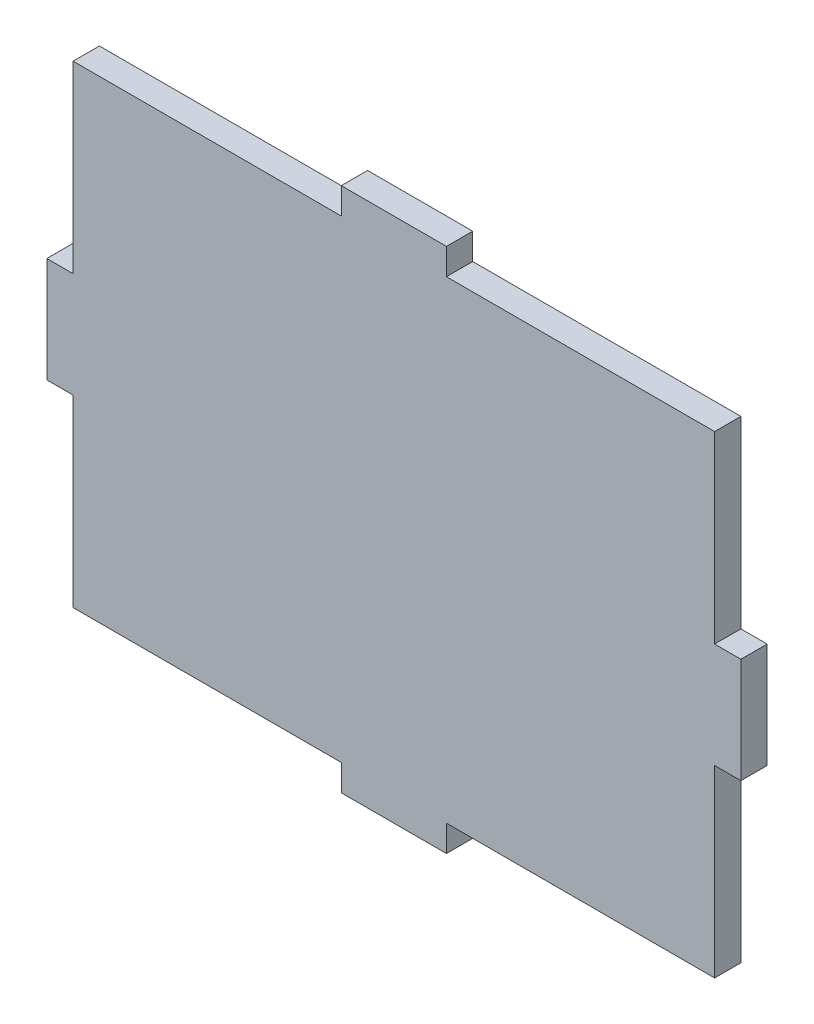
ISO-10303-21;
HEADER;
FILE_DESCRIPTION(('STEP AP214'),'2;1');
FILE_NAME('part.step','',(''),(''),'','','');
FILE_SCHEMA(('AUTOMOTIVE_DESIGN { 1 0 10303 214 1 1 1 1 }'));
ENDSEC;
DATA;
#1=APPLICATION_CONTEXT('core data for automotive mechanical design processes');
#2=APPLICATION_PROTOCOL_DEFINITION('international standard','automotive_design',2000,#1);
#3=PRODUCT_CONTEXT('',#1,'mechanical');
#4=PRODUCT('Part','Part','',(#3));
#5=PRODUCT_RELATED_PRODUCT_CATEGORY('part','',(#4));
#6=PRODUCT_DEFINITION_FORMATION('','',#4);
#7=PRODUCT_DEFINITION_CONTEXT('part definition',#1,'design');
#8=PRODUCT_DEFINITION('design','',#6,#7);
#9=PRODUCT_DEFINITION_SHAPE('','',#8);
#10=(LENGTH_UNIT() NAMED_UNIT(*) SI_UNIT(.MILLI.,.METRE.));
#11=(NAMED_UNIT(*) PLANE_ANGLE_UNIT() SI_UNIT($,.RADIAN.));
#12=(NAMED_UNIT(*) SI_UNIT($,.STERADIAN.) SOLID_ANGLE_UNIT());
#13=UNCERTAINTY_MEASURE_WITH_UNIT(LENGTH_MEASURE(1.E-05),#10,'distance_accuracy_value','');
#14=(GEOMETRIC_REPRESENTATION_CONTEXT(3) GLOBAL_UNCERTAINTY_ASSIGNED_CONTEXT((#13)) GLOBAL_UNIT_ASSIGNED_CONTEXT((#10,
#11,#12)) REPRESENTATION_CONTEXT('',''));
#15=CARTESIAN_POINT('',(0.,0.,0.));
#16=DIRECTION('',(0.,0.,1.));
#17=DIRECTION('',(1.,0.,0.));
#18=AXIS2_PLACEMENT_3D('',#15,#16,#17);
#19=CARTESIAN_POINT('',(38.735,6.35,3.175));
#20=DIRECTION('',(-1.,0.,0.));
#21=DIRECTION('',(0.,0.,1.));
#22=AXIS2_PLACEMENT_3D('',#19,#20,#21);
#23=PLANE('',#22);
#24=DIRECTION('',(0.,1.,0.));
#25=VECTOR('',#24,1.);
#26=CARTESIAN_POINT('',(38.735,6.35,0.));
#27=LINE('',#26,#25);
#28=CARTESIAN_POINT('',(38.735,6.35,0.));
#29=VERTEX_POINT('',#28);
#30=CARTESIAN_POINT('',(38.735,28.575,0.));
#31=VERTEX_POINT('',#30);
#32=EDGE_CURVE('E212',#29,#31,#27,.T.);
#33=ORIENTED_EDGE('',*,*,#32,.T.);
#34=DIRECTION('',(0.,0.,-1.));
#35=VECTOR('',#34,1.);
#36=CARTESIAN_POINT('',(38.735,28.575,3.175));
#37=LINE('',#36,#35);
#38=CARTESIAN_POINT('',(38.735,28.575,3.175));
#39=VERTEX_POINT('',#38);
#40=EDGE_CURVE('E11',#39,#31,#37,.T.);
#41=ORIENTED_EDGE('',*,*,#40,.F.);
#42=DIRECTION('',(0.,1.,0.));
#43=VECTOR('',#42,1.);
#44=CARTESIAN_POINT('',(38.735,6.35,3.175));
#45=LINE('',#44,#43);
#46=CARTESIAN_POINT('',(38.735,6.35,3.175));
#47=VERTEX_POINT('',#46);
#48=EDGE_CURVE('E270',#47,#39,#45,.T.);
#49=ORIENTED_EDGE('',*,*,#48,.F.);
#50=DIRECTION('',(0.,0.,-1.));
#51=VECTOR('',#50,1.);
#52=CARTESIAN_POINT('',(38.735,6.35,3.175));
#53=LINE('',#52,#51);
#54=EDGE_CURVE('E208',#47,#29,#53,.T.);
#55=ORIENTED_EDGE('',*,*,#54,.T.);
#56=EDGE_LOOP('',(#33,#41,#49,#55));
#57=FACE_BOUND('',#56,.T.);
#58=ADVANCED_FACE('F39',(#57),#23,.F.);
#59=CARTESIAN_POINT('',(6.34999999999999,28.575,3.175));
#60=DIRECTION('',(0.,-1.,0.));
#61=DIRECTION('',(0.,0.,-1.));
#62=AXIS2_PLACEMENT_3D('',#59,#60,#61);
#63=PLANE('',#62);
#64=DIRECTION('',(-1.,0.,0.));
#65=VECTOR('',#64,1.);
#66=CARTESIAN_POINT('',(6.34999999999999,28.575,0.));
#67=LINE('',#66,#65);
#68=CARTESIAN_POINT('',(6.34999999999999,28.575,0.));
#69=VERTEX_POINT('',#68);
#70=EDGE_CURVE('E216',#31,#69,#67,.T.);
#71=ORIENTED_EDGE('',*,*,#70,.T.);
#72=DIRECTION('',(0.,0.,-1.));
#73=VECTOR('',#72,1.);
#74=CARTESIAN_POINT('',(6.34999999999999,28.575,3.175));
#75=LINE('',#74,#73);
#76=CARTESIAN_POINT('',(6.34999999999999,28.575,3.175));
#77=VERTEX_POINT('',#76);
#78=EDGE_CURVE('E48',#77,#69,#75,.T.);
#79=ORIENTED_EDGE('',*,*,#78,.F.);
#80=DIRECTION('',(-1.,0.,0.));
#81=VECTOR('',#80,1.);
#82=CARTESIAN_POINT('',(6.34999999999999,28.575,3.175));
#83=LINE('',#82,#81);
#84=EDGE_CURVE('E135',#39,#77,#83,.T.);
#85=ORIENTED_EDGE('',*,*,#84,.F.);
#86=ORIENTED_EDGE('',*,*,#40,.T.);
#87=EDGE_LOOP('',(#71,#79,#85,#86));
#88=FACE_BOUND('',#87,.T.);
#89=ADVANCED_FACE('F420',(#88),#63,.F.);
#90=CARTESIAN_POINT('',(6.34999999999999,31.75,3.175));
#91=DIRECTION('',(-1.,0.,0.));
#92=DIRECTION('',(0.,0.,1.));
#93=AXIS2_PLACEMENT_3D('',#90,#91,#92);
#94=PLANE('',#93);
#95=DIRECTION('',(0.,1.,0.));
#96=VECTOR('',#95,1.);
#97=CARTESIAN_POINT('',(6.34999999999999,31.75,0.));
#98=LINE('',#97,#96);
#99=CARTESIAN_POINT('',(6.34999999999999,31.75,0.));
#100=VERTEX_POINT('',#99);
#101=EDGE_CURVE('E219',#69,#100,#98,.T.);
#102=ORIENTED_EDGE('',*,*,#101,.T.);
#103=DIRECTION('',(0.,0.,-1.));
#104=VECTOR('',#103,1.);
#105=CARTESIAN_POINT('',(6.34999999999999,31.75,3.175));
#106=LINE('',#105,#104);
#107=CARTESIAN_POINT('',(6.34999999999999,31.75,3.175));
#108=VERTEX_POINT('',#107);
#109=EDGE_CURVE('E329',#108,#100,#106,.T.);
#110=ORIENTED_EDGE('',*,*,#109,.F.);
#111=DIRECTION('',(0.,1.,0.));
#112=VECTOR('',#111,1.);
#113=CARTESIAN_POINT('',(6.34999999999999,31.75,3.175));
#114=LINE('',#113,#112);
#115=EDGE_CURVE('E339',#77,#108,#114,.T.);
#116=ORIENTED_EDGE('',*,*,#115,.F.);
#117=ORIENTED_EDGE('',*,*,#78,.T.);
#118=EDGE_LOOP('',(#102,#110,#116,#117));
#119=FACE_BOUND('',#118,.T.);
#120=ADVANCED_FACE('F337',(#119),#94,.F.);
#121=CARTESIAN_POINT('',(-6.35,31.75,3.175));
#122=DIRECTION('',(0.,-1.,0.));
#123=DIRECTION('',(0.,0.,-1.));
#124=AXIS2_PLACEMENT_3D('',#121,#122,#123);
#125=PLANE('',#124);
#126=DIRECTION('',(-1.,0.,0.));
#127=VECTOR('',#126,1.);
#128=CARTESIAN_POINT('',(-6.35,31.75,0.));
#129=LINE('',#128,#127);
#130=CARTESIAN_POINT('',(-6.35,31.75,0.));
#131=VERTEX_POINT('',#130);
#132=EDGE_CURVE('E222',#100,#131,#129,.T.);
#133=ORIENTED_EDGE('',*,*,#132,.T.);
#134=DIRECTION('',(0.,0.,-1.));
#135=VECTOR('',#134,1.);
#136=CARTESIAN_POINT('',(-6.35,31.75,3.175));
#137=LINE('',#136,#135);
#138=CARTESIAN_POINT('',(-6.35,31.75,3.175));
#139=VERTEX_POINT('',#138);
#140=EDGE_CURVE('E325',#139,#131,#137,.T.);
#141=ORIENTED_EDGE('',*,*,#140,.F.);
#142=DIRECTION('',(-1.,0.,0.));
#143=VECTOR('',#142,1.);
#144=CARTESIAN_POINT('',(-6.35,31.75,3.175));
#145=LINE('',#144,#143);
#146=EDGE_CURVE('E358',#108,#139,#145,.T.);
#147=ORIENTED_EDGE('',*,*,#146,.F.);
#148=ORIENTED_EDGE('',*,*,#109,.T.);
#149=EDGE_LOOP('',(#133,#141,#147,#148));
#150=FACE_BOUND('',#149,.T.);
#151=ADVANCED_FACE('F348',(#150),#125,.F.);
#152=CARTESIAN_POINT('',(-6.35,28.575,3.175));
#153=DIRECTION('',(1.,0.,0.));
#154=DIRECTION('',(0.,0.,-1.));
#155=AXIS2_PLACEMENT_3D('',#152,#153,#154);
#156=PLANE('',#155);
#157=DIRECTION('',(0.,-1.,0.));
#158=VECTOR('',#157,1.);
#159=CARTESIAN_POINT('',(-6.35,28.575,0.));
#160=LINE('',#159,#158);
#161=CARTESIAN_POINT('',(-6.35,28.575,0.));
#162=VERTEX_POINT('',#161);
#163=EDGE_CURVE('E225',#131,#162,#160,.T.);
#164=ORIENTED_EDGE('',*,*,#163,.T.);
#165=DIRECTION('',(0.,0.,-1.));
#166=VECTOR('',#165,1.);
#167=CARTESIAN_POINT('',(-6.35,28.575,3.175));
#168=LINE('',#167,#166);
#169=CARTESIAN_POINT('',(-6.35,28.575,3.175));
#170=VERTEX_POINT('',#169);
#171=EDGE_CURVE('E321',#170,#162,#168,.T.);
#172=ORIENTED_EDGE('',*,*,#171,.F.);
#173=DIRECTION('',(0.,-1.,0.));
#174=VECTOR('',#173,1.);
#175=CARTESIAN_POINT('',(-6.35,28.575,3.175));
#176=LINE('',#175,#174);
#177=EDGE_CURVE('E354',#139,#170,#176,.T.);
#178=ORIENTED_EDGE('',*,*,#177,.F.);
#179=ORIENTED_EDGE('',*,*,#140,.T.);
#180=EDGE_LOOP('',(#164,#172,#178,#179));
#181=FACE_BOUND('',#180,.T.);
#182=ADVANCED_FACE('F352',(#181),#156,.F.);
#183=CARTESIAN_POINT('',(-38.735,28.575,3.175));
#184=DIRECTION('',(0.,-1.,0.));
#185=DIRECTION('',(1.,0.,0.));
#186=AXIS2_PLACEMENT_3D('',#183,#184,#185);
#187=PLANE('',#186);
#188=DIRECTION('',(-1.,0.,0.));
#189=VECTOR('',#188,1.);
#190=CARTESIAN_POINT('',(-38.735,28.575,0.));
#191=LINE('',#190,#189);
#192=CARTESIAN_POINT('',(-38.735,28.575,0.));
#193=VERTEX_POINT('',#192);
#194=EDGE_CURVE('E228',#162,#193,#191,.T.);
#195=ORIENTED_EDGE('',*,*,#194,.T.);
#196=DIRECTION('',(0.,0.,-1.));
#197=VECTOR('',#196,1.);
#198=CARTESIAN_POINT('',(-38.735,28.575,3.175));
#199=LINE('',#198,#197);
#200=CARTESIAN_POINT('',(-38.735,28.575,3.175));
#201=VERTEX_POINT('',#200);
#202=EDGE_CURVE('E317',#201,#193,#199,.T.);
#203=ORIENTED_EDGE('',*,*,#202,.F.);
#204=DIRECTION('',(-1.,0.,0.));
#205=VECTOR('',#204,1.);
#206=CARTESIAN_POINT('',(-38.735,28.575,3.175));
#207=LINE('',#206,#205);
#208=EDGE_CURVE('E357',#170,#201,#207,.T.);
#209=ORIENTED_EDGE('',*,*,#208,.F.);
#210=ORIENTED_EDGE('',*,*,#171,.T.);
#211=EDGE_LOOP('',(#195,#203,#209,#210));
#212=FACE_BOUND('',#211,.T.);
#213=ADVANCED_FACE('F433',(#212),#187,.F.);
#214=CARTESIAN_POINT('',(-38.735,6.35000000000001,3.175));
#215=DIRECTION('',(1.,0.,0.));
#216=DIRECTION('',(0.,0.,-1.));
#217=AXIS2_PLACEMENT_3D('',#214,#215,#216);
#218=PLANE('',#217);
#219=DIRECTION('',(0.,-1.,0.));
#220=VECTOR('',#219,1.);
#221=CARTESIAN_POINT('',(-38.735,6.35000000000001,0.));
#222=LINE('',#221,#220);
#223=CARTESIAN_POINT('',(-38.735,6.35000000000001,0.));
#224=VERTEX_POINT('',#223);
#225=EDGE_CURVE('E231',#193,#224,#222,.T.);
#226=ORIENTED_EDGE('',*,*,#225,.T.);
#227=DIRECTION('',(0.,0.,-1.));
#228=VECTOR('',#227,1.);
#229=CARTESIAN_POINT('',(-38.735,6.35000000000001,3.175));
#230=LINE('',#229,#228);
#231=CARTESIAN_POINT('',(-38.735,6.35000000000001,3.175));
#232=VERTEX_POINT('',#231);
#233=EDGE_CURVE('E313',#232,#224,#230,.T.);
#234=ORIENTED_EDGE('',*,*,#233,.F.);
#235=DIRECTION('',(0.,-1.,0.));
#236=VECTOR('',#235,1.);
#237=CARTESIAN_POINT('',(-38.735,6.35000000000001,3.175));
#238=LINE('',#237,#236);
#239=EDGE_CURVE('E362',#201,#232,#238,.T.);
#240=ORIENTED_EDGE('',*,*,#239,.F.);
#241=ORIENTED_EDGE('',*,*,#202,.T.);
#242=EDGE_LOOP('',(#226,#234,#240,#241));
#243=FACE_BOUND('',#242,.T.);
#244=ADVANCED_FACE('F436',(#243),#218,.F.);
#245=CARTESIAN_POINT('',(-38.735,6.35000000000001,3.175));
#246=DIRECTION('',(0.,-1.,0.));
#247=DIRECTION('',(1.,0.,0.));
#248=AXIS2_PLACEMENT_3D('',#245,#246,#247);
#249=PLANE('',#248);
#250=DIRECTION('',(-1.,0.,0.));
#251=VECTOR('',#250,1.);
#252=CARTESIAN_POINT('',(-38.735,6.35000000000001,0.));
#253=LINE('',#252,#251);
#254=CARTESIAN_POINT('',(-41.91,6.34999999999999,0.));
#255=VERTEX_POINT('',#254);
#256=EDGE_CURVE('E234',#224,#255,#253,.T.);
#257=ORIENTED_EDGE('',*,*,#256,.T.);
#258=DIRECTION('',(0.,0.,-1.));
#259=VECTOR('',#258,1.);
#260=CARTESIAN_POINT('',(-41.91,6.34999999999999,3.175));
#261=LINE('',#260,#259);
#262=CARTESIAN_POINT('',(-41.91,6.34999999999999,3.175));
#263=VERTEX_POINT('',#262);
#264=EDGE_CURVE('E309',#263,#255,#261,.T.);
#265=ORIENTED_EDGE('',*,*,#264,.F.);
#266=DIRECTION('',(-1.,0.,0.));
#267=VECTOR('',#266,1.);
#268=CARTESIAN_POINT('',(-38.735,6.35000000000001,3.175));
#269=LINE('',#268,#267);
#270=EDGE_CURVE('E369',#232,#263,#269,.T.);
#271=ORIENTED_EDGE('',*,*,#270,.F.);
#272=ORIENTED_EDGE('',*,*,#233,.T.);
#273=EDGE_LOOP('',(#257,#265,#271,#272));
#274=FACE_BOUND('',#273,.T.);
#275=ADVANCED_FACE('F440',(#274),#249,.F.);
#276=CARTESIAN_POINT('',(-41.91,6.34999999999999,3.175));
#277=DIRECTION('',(1.,0.,0.));
#278=DIRECTION('',(0.,0.,-1.));
#279=AXIS2_PLACEMENT_3D('',#276,#277,#278);
#280=PLANE('',#279);
#281=DIRECTION('',(0.,-1.,0.));
#282=VECTOR('',#281,1.);
#283=CARTESIAN_POINT('',(-41.91,6.34999999999999,0.));
#284=LINE('',#283,#282);
#285=CARTESIAN_POINT('',(-41.91,-6.35,0.));
#286=VERTEX_POINT('',#285);
#287=EDGE_CURVE('E237',#255,#286,#284,.T.);
#288=ORIENTED_EDGE('',*,*,#287,.T.);
#289=DIRECTION('',(0.,0.,-1.));
#290=VECTOR('',#289,1.);
#291=CARTESIAN_POINT('',(-41.91,-6.35,3.175));
#292=LINE('',#291,#290);
#293=CARTESIAN_POINT('',(-41.91,-6.35,3.175));
#294=VERTEX_POINT('',#293);
#295=EDGE_CURVE('E305',#294,#286,#292,.T.);
#296=ORIENTED_EDGE('',*,*,#295,.F.);
#297=DIRECTION('',(0.,-1.,0.));
#298=VECTOR('',#297,1.);
#299=CARTESIAN_POINT('',(-41.91,6.34999999999999,3.175));
#300=LINE('',#299,#298);
#301=EDGE_CURVE('E372',#263,#294,#300,.T.);
#302=ORIENTED_EDGE('',*,*,#301,.F.);
#303=ORIENTED_EDGE('',*,*,#264,.T.);
#304=EDGE_LOOP('',(#288,#296,#302,#303));
#305=FACE_BOUND('',#304,.T.);
#306=ADVANCED_FACE('F444',(#305),#280,.F.);
#307=CARTESIAN_POINT('',(-41.91,-6.35,3.175));
#308=DIRECTION('',(0.,1.,0.));
#309=DIRECTION('',(-1.,0.,0.));
#310=AXIS2_PLACEMENT_3D('',#307,#308,#309);
#311=PLANE('',#310);
#312=DIRECTION('',(1.,0.,0.));
#313=VECTOR('',#312,1.);
#314=CARTESIAN_POINT('',(-41.91,-6.35,0.));
#315=LINE('',#314,#313);
#316=CARTESIAN_POINT('',(-38.735,-6.35,0.));
#317=VERTEX_POINT('',#316);
#318=EDGE_CURVE('E240',#286,#317,#315,.T.);
#319=ORIENTED_EDGE('',*,*,#318,.T.);
#320=DIRECTION('',(0.,0.,-1.));
#321=VECTOR('',#320,1.);
#322=CARTESIAN_POINT('',(-38.735,-6.35,3.175));
#323=LINE('',#322,#321);
#324=CARTESIAN_POINT('',(-38.735,-6.35,3.175));
#325=VERTEX_POINT('',#324);
#326=EDGE_CURVE('E301',#325,#317,#323,.T.);
#327=ORIENTED_EDGE('',*,*,#326,.F.);
#328=DIRECTION('',(1.,0.,0.));
#329=VECTOR('',#328,1.);
#330=CARTESIAN_POINT('',(-41.91,-6.35,3.175));
#331=LINE('',#330,#329);
#332=EDGE_CURVE('E375',#294,#325,#331,.T.);
#333=ORIENTED_EDGE('',*,*,#332,.F.);
#334=ORIENTED_EDGE('',*,*,#295,.T.);
#335=EDGE_LOOP('',(#319,#327,#333,#334));
#336=FACE_BOUND('',#335,.T.);
#337=ADVANCED_FACE('F448',(#336),#311,.F.);
#338=CARTESIAN_POINT('',(-38.735,-28.575,3.175));
#339=DIRECTION('',(1.,0.,0.));
#340=DIRECTION('',(0.,0.,-1.));
#341=AXIS2_PLACEMENT_3D('',#338,#339,#340);
#342=PLANE('',#341);
#343=DIRECTION('',(0.,-1.,0.));
#344=VECTOR('',#343,1.);
#345=CARTESIAN_POINT('',(-38.735,-28.575,0.));
#346=LINE('',#345,#344);
#347=CARTESIAN_POINT('',(-38.735,-28.575,0.));
#348=VERTEX_POINT('',#347);
#349=EDGE_CURVE('E243',#317,#348,#346,.T.);
#350=ORIENTED_EDGE('',*,*,#349,.T.);
#351=DIRECTION('',(0.,0.,-1.));
#352=VECTOR('',#351,1.);
#353=CARTESIAN_POINT('',(-38.735,-28.575,3.175));
#354=LINE('',#353,#352);
#355=CARTESIAN_POINT('',(-38.735,-28.575,3.175));
#356=VERTEX_POINT('',#355);
#357=EDGE_CURVE('E297',#356,#348,#354,.T.);
#358=ORIENTED_EDGE('',*,*,#357,.F.);
#359=DIRECTION('',(0.,-1.,0.));
#360=VECTOR('',#359,1.);
#361=CARTESIAN_POINT('',(-38.735,-28.575,3.175));
#362=LINE('',#361,#360);
#363=EDGE_CURVE('E378',#325,#356,#362,.T.);
#364=ORIENTED_EDGE('',*,*,#363,.F.);
#365=ORIENTED_EDGE('',*,*,#326,.T.);
#366=EDGE_LOOP('',(#350,#358,#364,#365));
#367=FACE_BOUND('',#366,.T.);
#368=ADVANCED_FACE('F452',(#367),#342,.F.);
#369=CARTESIAN_POINT('',(-38.735,-28.575,3.175));
#370=DIRECTION('',(0.,1.,0.));
#371=DIRECTION('',(0.,0.,1.));
#372=AXIS2_PLACEMENT_3D('',#369,#370,#371);
#373=PLANE('',#372);
#374=DIRECTION('',(1.,0.,0.));
#375=VECTOR('',#374,1.);
#376=CARTESIAN_POINT('',(-38.735,-28.575,0.));
#377=LINE('',#376,#375);
#378=CARTESIAN_POINT('',(-6.35000000000001,-28.575,0.));
#379=VERTEX_POINT('',#378);
#380=EDGE_CURVE('E246',#348,#379,#377,.T.);
#381=ORIENTED_EDGE('',*,*,#380,.T.);
#382=DIRECTION('',(0.,0.,-1.));
#383=VECTOR('',#382,1.);
#384=CARTESIAN_POINT('',(-6.35000000000001,-28.575,3.175));
#385=LINE('',#384,#383);
#386=CARTESIAN_POINT('',(-6.35000000000001,-28.575,3.175));
#387=VERTEX_POINT('',#386);
#388=EDGE_CURVE('E293',#387,#379,#385,.T.);
#389=ORIENTED_EDGE('',*,*,#388,.F.);
#390=DIRECTION('',(1.,0.,0.));
#391=VECTOR('',#390,1.);
#392=CARTESIAN_POINT('',(-38.735,-28.575,3.175));
#393=LINE('',#392,#391);
#394=EDGE_CURVE('E381',#356,#387,#393,.T.);
#395=ORIENTED_EDGE('',*,*,#394,.F.);
#396=ORIENTED_EDGE('',*,*,#357,.T.);
#397=EDGE_LOOP('',(#381,#389,#395,#396));
#398=FACE_BOUND('',#397,.T.);
#399=ADVANCED_FACE('F456',(#398),#373,.F.);
#400=CARTESIAN_POINT('',(-6.35000000000001,-28.575,3.175));
#401=DIRECTION('',(1.,0.,0.));
#402=DIRECTION('',(0.,0.,-1.));
#403=AXIS2_PLACEMENT_3D('',#400,#401,#402);
#404=PLANE('',#403);
#405=DIRECTION('',(0.,-1.,0.));
#406=VECTOR('',#405,1.);
#407=CARTESIAN_POINT('',(-6.35000000000001,-28.575,0.));
#408=LINE('',#407,#406);
#409=CARTESIAN_POINT('',(-6.35000000000001,-31.75,0.));
#410=VERTEX_POINT('',#409);
#411=EDGE_CURVE('E249',#379,#410,#408,.T.);
#412=ORIENTED_EDGE('',*,*,#411,.T.);
#413=DIRECTION('',(0.,0.,-1.));
#414=VECTOR('',#413,1.);
#415=CARTESIAN_POINT('',(-6.35000000000001,-31.75,3.175));
#416=LINE('',#415,#414);
#417=CARTESIAN_POINT('',(-6.35000000000001,-31.75,3.175));
#418=VERTEX_POINT('',#417);
#419=EDGE_CURVE('E289',#418,#410,#416,.T.);
#420=ORIENTED_EDGE('',*,*,#419,.F.);
#421=DIRECTION('',(0.,-1.,0.));
#422=VECTOR('',#421,1.);
#423=CARTESIAN_POINT('',(-6.35000000000001,-28.575,3.175));
#424=LINE('',#423,#422);
#425=EDGE_CURVE('E384',#387,#418,#424,.T.);
#426=ORIENTED_EDGE('',*,*,#425,.F.);
#427=ORIENTED_EDGE('',*,*,#388,.T.);
#428=EDGE_LOOP('',(#412,#420,#426,#427));
#429=FACE_BOUND('',#428,.T.);
#430=ADVANCED_FACE('F460',(#429),#404,.F.);
#431=CARTESIAN_POINT('',(-6.35000000000001,-31.75,3.175));
#432=DIRECTION('',(0.,1.,0.));
#433=DIRECTION('',(-1.,0.,0.));
#434=AXIS2_PLACEMENT_3D('',#431,#432,#433);
#435=PLANE('',#434);
#436=DIRECTION('',(1.,0.,0.));
#437=VECTOR('',#436,1.);
#438=CARTESIAN_POINT('',(-6.35000000000001,-31.75,0.));
#439=LINE('',#438,#437);
#440=CARTESIAN_POINT('',(6.34999999999999,-31.75,0.));
#441=VERTEX_POINT('',#440);
#442=EDGE_CURVE('E252',#410,#441,#439,.T.);
#443=ORIENTED_EDGE('',*,*,#442,.T.);
#444=DIRECTION('',(0.,0.,-1.));
#445=VECTOR('',#444,1.);
#446=CARTESIAN_POINT('',(6.34999999999999,-31.75,3.175));
#447=LINE('',#446,#445);
#448=CARTESIAN_POINT('',(6.34999999999999,-31.75,3.175));
#449=VERTEX_POINT('',#448);
#450=EDGE_CURVE('E285',#449,#441,#447,.T.);
#451=ORIENTED_EDGE('',*,*,#450,.F.);
#452=DIRECTION('',(1.,0.,0.));
#453=VECTOR('',#452,1.);
#454=CARTESIAN_POINT('',(-6.35000000000001,-31.75,3.175));
#455=LINE('',#454,#453);
#456=EDGE_CURVE('E387',#418,#449,#455,.T.);
#457=ORIENTED_EDGE('',*,*,#456,.F.);
#458=ORIENTED_EDGE('',*,*,#419,.T.);
#459=EDGE_LOOP('',(#443,#451,#457,#458));
#460=FACE_BOUND('',#459,.T.);
#461=ADVANCED_FACE('F464',(#460),#435,.F.);
#462=CARTESIAN_POINT('',(6.34999999999999,-31.75,3.175));
#463=DIRECTION('',(-1.,0.,0.));
#464=DIRECTION('',(0.,0.,1.));
#465=AXIS2_PLACEMENT_3D('',#462,#463,#464);
#466=PLANE('',#465);
#467=DIRECTION('',(0.,1.,0.));
#468=VECTOR('',#467,1.);
#469=CARTESIAN_POINT('',(6.34999999999999,-31.75,0.));
#470=LINE('',#469,#468);
#471=CARTESIAN_POINT('',(6.34999999999999,-28.575,0.));
#472=VERTEX_POINT('',#471);
#473=EDGE_CURVE('E255',#441,#472,#470,.T.);
#474=ORIENTED_EDGE('',*,*,#473,.T.);
#475=DIRECTION('',(0.,0.,-1.));
#476=VECTOR('',#475,1.);
#477=CARTESIAN_POINT('',(6.34999999999999,-28.575,3.175));
#478=LINE('',#477,#476);
#479=CARTESIAN_POINT('',(6.34999999999999,-28.575,3.175));
#480=VERTEX_POINT('',#479);
#481=EDGE_CURVE('E281',#480,#472,#478,.T.);
#482=ORIENTED_EDGE('',*,*,#481,.F.);
#483=DIRECTION('',(0.,1.,0.));
#484=VECTOR('',#483,1.);
#485=CARTESIAN_POINT('',(6.34999999999999,-31.75,3.175));
#486=LINE('',#485,#484);
#487=EDGE_CURVE('E390',#449,#480,#486,.T.);
#488=ORIENTED_EDGE('',*,*,#487,.F.);
#489=ORIENTED_EDGE('',*,*,#450,.T.);
#490=EDGE_LOOP('',(#474,#482,#488,#489));
#491=FACE_BOUND('',#490,.T.);
#492=ADVANCED_FACE('F468',(#491),#466,.F.);
#493=CARTESIAN_POINT('',(6.34999999999999,-28.575,3.175));
#494=DIRECTION('',(0.,1.,0.));
#495=DIRECTION('',(0.,0.,1.));
#496=AXIS2_PLACEMENT_3D('',#493,#494,#495);
#497=PLANE('',#496);
#498=DIRECTION('',(1.,0.,0.));
#499=VECTOR('',#498,1.);
#500=CARTESIAN_POINT('',(6.34999999999999,-28.575,0.));
#501=LINE('',#500,#499);
#502=CARTESIAN_POINT('',(38.735,-28.575,0.));
#503=VERTEX_POINT('',#502);
#504=EDGE_CURVE('E258',#472,#503,#501,.T.);
#505=ORIENTED_EDGE('',*,*,#504,.T.);
#506=DIRECTION('',(0.,0.,-1.));
#507=VECTOR('',#506,1.);
#508=CARTESIAN_POINT('',(38.735,-28.575,3.175));
#509=LINE('',#508,#507);
#510=CARTESIAN_POINT('',(38.735,-28.575,3.175));
#511=VERTEX_POINT('',#510);
#512=EDGE_CURVE('E277',#511,#503,#509,.T.);
#513=ORIENTED_EDGE('',*,*,#512,.F.);
#514=DIRECTION('',(1.,0.,0.));
#515=VECTOR('',#514,1.);
#516=CARTESIAN_POINT('',(6.34999999999999,-28.575,3.175));
#517=LINE('',#516,#515);
#518=EDGE_CURVE('E393',#480,#511,#517,.T.);
#519=ORIENTED_EDGE('',*,*,#518,.F.);
#520=ORIENTED_EDGE('',*,*,#481,.T.);
#521=EDGE_LOOP('',(#505,#513,#519,#520));
#522=FACE_BOUND('',#521,.T.);
#523=ADVANCED_FACE('F401',(#522),#497,.F.);
#524=CARTESIAN_POINT('',(38.735,-28.575,3.175));
#525=DIRECTION('',(-1.,0.,0.));
#526=DIRECTION('',(0.,0.,1.));
#527=AXIS2_PLACEMENT_3D('',#524,#525,#526);
#528=PLANE('',#527);
#529=DIRECTION('',(0.,1.,0.));
#530=VECTOR('',#529,1.);
#531=CARTESIAN_POINT('',(38.735,-28.575,0.));
#532=LINE('',#531,#530);
#533=CARTESIAN_POINT('',(38.735,-6.35,0.));
#534=VERTEX_POINT('',#533);
#535=EDGE_CURVE('E261',#503,#534,#532,.T.);
#536=ORIENTED_EDGE('',*,*,#535,.T.);
#537=DIRECTION('',(0.,0.,-1.));
#538=VECTOR('',#537,1.);
#539=CARTESIAN_POINT('',(38.735,-6.35,3.175));
#540=LINE('',#539,#538);
#541=CARTESIAN_POINT('',(38.735,-6.35,3.175));
#542=VERTEX_POINT('',#541);
#543=EDGE_CURVE('E201',#542,#534,#540,.T.);
#544=ORIENTED_EDGE('',*,*,#543,.F.);
#545=DIRECTION('',(0.,1.,0.));
#546=VECTOR('',#545,1.);
#547=CARTESIAN_POINT('',(38.735,-28.575,3.175));
#548=LINE('',#547,#546);
#549=EDGE_CURVE('E190',#511,#542,#548,.T.);
#550=ORIENTED_EDGE('',*,*,#549,.F.);
#551=ORIENTED_EDGE('',*,*,#512,.T.);
#552=EDGE_LOOP('',(#536,#544,#550,#551));
#553=FACE_BOUND('',#552,.T.);
#554=ADVANCED_FACE('F405',(#553),#528,.F.);
#555=CARTESIAN_POINT('',(41.91,-6.35,3.175));
#556=DIRECTION('',(0.,1.,0.));
#557=DIRECTION('',(-1.,0.,0.));
#558=AXIS2_PLACEMENT_3D('',#555,#556,#557);
#559=PLANE('',#558);
#560=DIRECTION('',(1.,0.,0.));
#561=VECTOR('',#560,1.);
#562=CARTESIAN_POINT('',(41.91,-6.35,0.));
#563=LINE('',#562,#561);
#564=CARTESIAN_POINT('',(41.91,-6.35,0.));
#565=VERTEX_POINT('',#564);
#566=EDGE_CURVE('E199',#534,#565,#563,.T.);
#567=ORIENTED_EDGE('',*,*,#566,.T.);
#568=DIRECTION('',(0.,0.,-1.));
#569=VECTOR('',#568,1.);
#570=CARTESIAN_POINT('',(41.91,-6.35,3.175));
#571=LINE('',#570,#569);
#572=CARTESIAN_POINT('',(41.91,-6.35,3.175));
#573=VERTEX_POINT('',#572);
#574=EDGE_CURVE('E196',#573,#565,#571,.T.);
#575=ORIENTED_EDGE('',*,*,#574,.F.);
#576=DIRECTION('',(1.,0.,0.));
#577=VECTOR('',#576,1.);
#578=CARTESIAN_POINT('',(41.91,-6.35,3.175));
#579=LINE('',#578,#577);
#580=EDGE_CURVE('E184',#542,#573,#579,.T.);
#581=ORIENTED_EDGE('',*,*,#580,.F.);
#582=ORIENTED_EDGE('',*,*,#543,.T.);
#583=EDGE_LOOP('',(#567,#575,#581,#582));
#584=FACE_BOUND('',#583,.T.);
#585=ADVANCED_FACE('F197',(#584),#559,.F.);
#586=CARTESIAN_POINT('',(41.91,6.35,3.175));
#587=DIRECTION('',(-1.,0.,0.));
#588=DIRECTION('',(0.,0.,1.));
#589=AXIS2_PLACEMENT_3D('',#586,#587,#588);
#590=PLANE('',#589);
#591=DIRECTION('',(0.,1.,0.));
#592=VECTOR('',#591,1.);
#593=CARTESIAN_POINT('',(41.91,6.35,0.));
#594=LINE('',#593,#592);
#595=CARTESIAN_POINT('',(41.91,6.35,0.));
#596=VERTEX_POINT('',#595);
#597=EDGE_CURVE('E121',#565,#596,#594,.T.);
#598=ORIENTED_EDGE('',*,*,#597,.T.);
#599=DIRECTION('',(0.,0.,-1.));
#600=VECTOR('',#599,1.);
#601=CARTESIAN_POINT('',(41.91,6.35,3.175));
#602=LINE('',#601,#600);
#603=CARTESIAN_POINT('',(41.91,6.35,3.175));
#604=VERTEX_POINT('',#603);
#605=EDGE_CURVE('E202',#604,#596,#602,.T.);
#606=ORIENTED_EDGE('',*,*,#605,.F.);
#607=DIRECTION('',(0.,1.,0.));
#608=VECTOR('',#607,1.);
#609=CARTESIAN_POINT('',(41.91,6.35,3.175));
#610=LINE('',#609,#608);
#611=EDGE_CURVE('E188',#573,#604,#610,.T.);
#612=ORIENTED_EDGE('',*,*,#611,.F.);
#613=ORIENTED_EDGE('',*,*,#574,.T.);
#614=EDGE_LOOP('',(#598,#606,#612,#613));
#615=FACE_BOUND('',#614,.T.);
#616=ADVANCED_FACE('F204',(#615),#590,.F.);
#617=CARTESIAN_POINT('',(38.735,6.35,3.175));
#618=DIRECTION('',(0.,-1.,0.));
#619=DIRECTION('',(1.,0.,0.));
#620=AXIS2_PLACEMENT_3D('',#617,#618,#619);
#621=PLANE('',#620);
#622=DIRECTION('',(-1.,0.,0.));
#623=VECTOR('',#622,1.);
#624=CARTESIAN_POINT('',(38.735,6.35,0.));
#625=LINE('',#624,#623);
#626=EDGE_CURVE('E127',#596,#29,#625,.T.);
#627=ORIENTED_EDGE('',*,*,#626,.T.);
#628=ORIENTED_EDGE('',*,*,#54,.F.);
#629=DIRECTION('',(-1.,0.,0.));
#630=VECTOR('',#629,1.);
#631=CARTESIAN_POINT('',(38.735,6.35,3.175));
#632=LINE('',#631,#630);
#633=EDGE_CURVE('E56',#604,#47,#632,.T.);
#634=ORIENTED_EDGE('',*,*,#633,.F.);
#635=ORIENTED_EDGE('',*,*,#605,.T.);
#636=EDGE_LOOP('',(#627,#628,#634,#635));
#637=FACE_BOUND('',#636,.T.);
#638=ADVANCED_FACE('F409',(#637),#621,.F.);
#639=CARTESIAN_POINT('',(0.,0.,3.175));
#640=DIRECTION('',(0.,0.,-1.));
#641=DIRECTION('',(-1.,0.,0.));
#642=AXIS2_PLACEMENT_3D('',#639,#640,#641);
#643=PLANE('',#642);
#644=ORIENTED_EDGE('',*,*,#48,.T.);
#645=ORIENTED_EDGE('',*,*,#84,.T.);
#646=ORIENTED_EDGE('',*,*,#115,.T.);
#647=ORIENTED_EDGE('',*,*,#146,.T.);
#648=ORIENTED_EDGE('',*,*,#177,.T.);
#649=ORIENTED_EDGE('',*,*,#208,.T.);
#650=ORIENTED_EDGE('',*,*,#239,.T.);
#651=ORIENTED_EDGE('',*,*,#270,.T.);
#652=ORIENTED_EDGE('',*,*,#301,.T.);
#653=ORIENTED_EDGE('',*,*,#332,.T.);
#654=ORIENTED_EDGE('',*,*,#363,.T.);
#655=ORIENTED_EDGE('',*,*,#394,.T.);
#656=ORIENTED_EDGE('',*,*,#425,.T.);
#657=ORIENTED_EDGE('',*,*,#456,.T.);
#658=ORIENTED_EDGE('',*,*,#487,.T.);
#659=ORIENTED_EDGE('',*,*,#518,.T.);
#660=ORIENTED_EDGE('',*,*,#549,.T.);
#661=ORIENTED_EDGE('',*,*,#580,.T.);
#662=ORIENTED_EDGE('',*,*,#611,.T.);
#663=ORIENTED_EDGE('',*,*,#633,.T.);
#664=EDGE_LOOP('',(#644,#645,#646,#647,#648,#649,#650,#651,#652,#653,#654,#655,#656,#657,#658,
#659,#660,#661,#662,#663));
#665=FACE_BOUND('',#664,.T.);
#666=ADVANCED_FACE('F186',(#665),#643,.F.);
#667=CARTESIAN_POINT('',(0.,0.,0.));
#668=DIRECTION('',(0.,0.,-1.));
#669=DIRECTION('',(-1.,0.,0.));
#670=AXIS2_PLACEMENT_3D('',#667,#668,#669);
#671=PLANE('',#670);
#672=ORIENTED_EDGE('',*,*,#32,.F.);
#673=ORIENTED_EDGE('',*,*,#626,.F.);
#674=ORIENTED_EDGE('',*,*,#597,.F.);
#675=ORIENTED_EDGE('',*,*,#566,.F.);
#676=ORIENTED_EDGE('',*,*,#535,.F.);
#677=ORIENTED_EDGE('',*,*,#504,.F.);
#678=ORIENTED_EDGE('',*,*,#473,.F.);
#679=ORIENTED_EDGE('',*,*,#442,.F.);
#680=ORIENTED_EDGE('',*,*,#411,.F.);
#681=ORIENTED_EDGE('',*,*,#380,.F.);
#682=ORIENTED_EDGE('',*,*,#349,.F.);
#683=ORIENTED_EDGE('',*,*,#318,.F.);
#684=ORIENTED_EDGE('',*,*,#287,.F.);
#685=ORIENTED_EDGE('',*,*,#256,.F.);
#686=ORIENTED_EDGE('',*,*,#225,.F.);
#687=ORIENTED_EDGE('',*,*,#194,.F.);
#688=ORIENTED_EDGE('',*,*,#163,.F.);
#689=ORIENTED_EDGE('',*,*,#132,.F.);
#690=ORIENTED_EDGE('',*,*,#101,.F.);
#691=ORIENTED_EDGE('',*,*,#70,.F.);
#692=EDGE_LOOP('',(#672,#673,#674,#675,#676,#677,#678,#679,#680,#681,#682,#683,#684,#685,#686,
#687,#688,#689,#690,#691));
#693=FACE_BOUND('',#692,.T.);
#694=ADVANCED_FACE('F343',(#693),#671,.T.);
#695=CLOSED_SHELL('',(#58,#89,#120,#151,#182,#213,#244,#275,#306,#337,#368,#399,#430,#461,#492,
#523,#554,#585,#616,#638,#666,#694));
#696=MANIFOLD_SOLID_BREP('B2',#695);
#697=ADVANCED_BREP_SHAPE_REPRESENTATION('',(#18,#696),#14);
#698=SHAPE_DEFINITION_REPRESENTATION(#9,#697);
ENDSEC;
END-ISO-10303-21;
